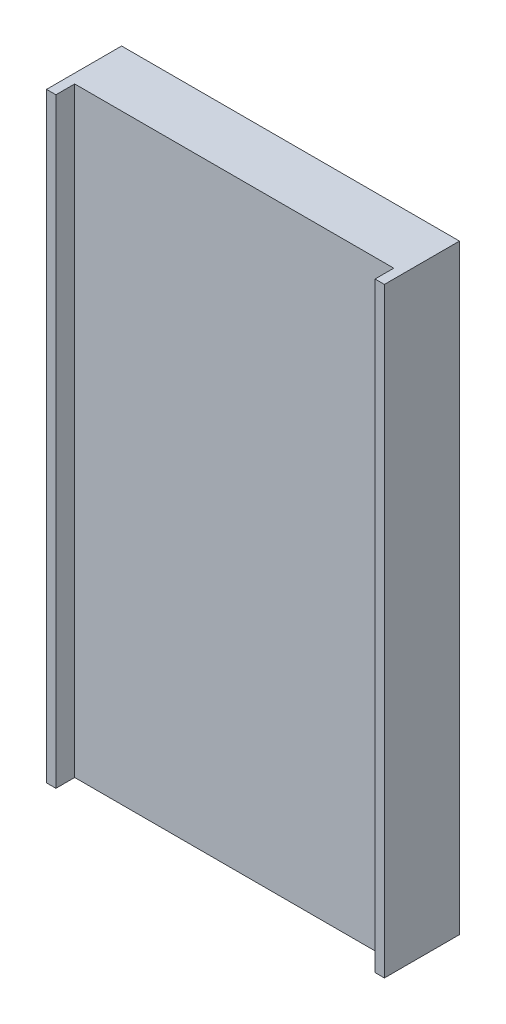
ISO-10303-21;
HEADER;
FILE_DESCRIPTION(('STEP AP214'),'2;1');
FILE_NAME('part.step','',(''),(''),'','','');
FILE_SCHEMA(('AUTOMOTIVE_DESIGN { 1 0 10303 214 1 1 1 1 }'));
ENDSEC;
DATA;
#1=APPLICATION_CONTEXT('core data for automotive mechanical design processes');
#2=APPLICATION_PROTOCOL_DEFINITION('international standard','automotive_design',2000,#1);
#3=PRODUCT_CONTEXT('',#1,'mechanical');
#4=PRODUCT('Part','Part','',(#3));
#5=PRODUCT_RELATED_PRODUCT_CATEGORY('part','',(#4));
#6=PRODUCT_DEFINITION_FORMATION('','',#4);
#7=PRODUCT_DEFINITION_CONTEXT('part definition',#1,'design');
#8=PRODUCT_DEFINITION('design','',#6,#7);
#9=PRODUCT_DEFINITION_SHAPE('','',#8);
#10=(LENGTH_UNIT() NAMED_UNIT(*) SI_UNIT(.MILLI.,.METRE.));
#11=(NAMED_UNIT(*) PLANE_ANGLE_UNIT() SI_UNIT($,.RADIAN.));
#12=(NAMED_UNIT(*) SI_UNIT($,.STERADIAN.) SOLID_ANGLE_UNIT());
#13=UNCERTAINTY_MEASURE_WITH_UNIT(LENGTH_MEASURE(1.E-05),#10,'distance_accuracy_value','');
#14=(GEOMETRIC_REPRESENTATION_CONTEXT(3) GLOBAL_UNCERTAINTY_ASSIGNED_CONTEXT((#13)) GLOBAL_UNIT_ASSIGNED_CONTEXT((#10,
#11,#12)) REPRESENTATION_CONTEXT('',''));
#15=CARTESIAN_POINT('',(0.,0.,0.));
#16=DIRECTION('',(0.,0.,1.));
#17=DIRECTION('',(1.,0.,0.));
#18=AXIS2_PLACEMENT_3D('',#15,#16,#17);
#19=CARTESIAN_POINT('',(0.,4.,0.75));
#20=DIRECTION('',(0.,1.,0.));
#21=DIRECTION('',(0.,0.,1.));
#22=AXIS2_PLACEMENT_3D('',#19,#20,#21);
#23=PLANE('',#22);
#24=DIRECTION('',(1.,0.,0.));
#25=VECTOR('',#24,1.);
#26=CARTESIAN_POINT('',(0.,4.,0.));
#27=LINE('',#26,#25);
#28=CARTESIAN_POINT('',(-2.25,4.,0.));
#29=VERTEX_POINT('',#28);
#30=CARTESIAN_POINT('',(2.25,4.,0.));
#31=VERTEX_POINT('',#30);
#32=EDGE_CURVE('E156',#29,#31,#27,.T.);
#33=ORIENTED_EDGE('',*,*,#32,.F.);
#34=DIRECTION('',(0.,0.,-1.));
#35=VECTOR('',#34,1.);
#36=CARTESIAN_POINT('',(-2.25,4.,1.));
#37=LINE('',#36,#35);
#38=CARTESIAN_POINT('',(-2.25,4.,1.));
#39=VERTEX_POINT('',#38);
#40=EDGE_CURVE('E108',#39,#29,#37,.T.);
#41=ORIENTED_EDGE('',*,*,#40,.F.);
#42=DIRECTION('',(1.,0.,0.));
#43=VECTOR('',#42,1.);
#44=CARTESIAN_POINT('',(0.,4.,1.));
#45=LINE('',#44,#43);
#46=CARTESIAN_POINT('',(-2.125,4.,1.));
#47=VERTEX_POINT('',#46);
#48=EDGE_CURVE('E113',#39,#47,#45,.T.);
#49=ORIENTED_EDGE('',*,*,#48,.T.);
#50=DIRECTION('',(0.,0.,-1.));
#51=VECTOR('',#50,1.);
#52=CARTESIAN_POINT('',(-2.125,4.,1.));
#53=LINE('',#52,#51);
#54=CARTESIAN_POINT('',(-2.125,4.,0.75));
#55=VERTEX_POINT('',#54);
#56=EDGE_CURVE('E101',#47,#55,#53,.T.);
#57=ORIENTED_EDGE('',*,*,#56,.T.);
#58=DIRECTION('',(1.,0.,0.));
#59=VECTOR('',#58,1.);
#60=CARTESIAN_POINT('',(0.,4.,0.75));
#61=LINE('',#60,#59);
#62=CARTESIAN_POINT('',(2.125,4.,0.75));
#63=VERTEX_POINT('',#62);
#64=EDGE_CURVE('E158',#55,#63,#61,.T.);
#65=ORIENTED_EDGE('',*,*,#64,.T.);
#66=DIRECTION('',(0.,0.,-1.));
#67=VECTOR('',#66,1.);
#68=CARTESIAN_POINT('',(2.125,4.,1.));
#69=LINE('',#68,#67);
#70=CARTESIAN_POINT('',(2.125,4.,1.));
#71=VERTEX_POINT('',#70);
#72=EDGE_CURVE('E153',#71,#63,#69,.T.);
#73=ORIENTED_EDGE('',*,*,#72,.F.);
#74=DIRECTION('',(1.,0.,0.));
#75=VECTOR('',#74,1.);
#76=CARTESIAN_POINT('',(0.,4.,1.));
#77=LINE('',#76,#75);
#78=CARTESIAN_POINT('',(2.25,4.,1.));
#79=VERTEX_POINT('',#78);
#80=EDGE_CURVE('E132',#71,#79,#77,.T.);
#81=ORIENTED_EDGE('',*,*,#80,.T.);
#82=DIRECTION('',(0.,0.,-1.));
#83=VECTOR('',#82,1.);
#84=CARTESIAN_POINT('',(2.25,4.,1.));
#85=LINE('',#84,#83);
#86=EDGE_CURVE('E142',#79,#31,#85,.T.);
#87=ORIENTED_EDGE('',*,*,#86,.T.);
#88=EDGE_LOOP('',(#33,#41,#49,#57,#65,#73,#81,#87));
#89=FACE_BOUND('',#88,.T.);
#90=ADVANCED_FACE('F36',(#89),#23,.T.);
#91=CARTESIAN_POINT('',(0.,-4.,0.75));
#92=DIRECTION('',(0.,1.,0.));
#93=DIRECTION('',(0.,0.,1.));
#94=AXIS2_PLACEMENT_3D('',#91,#92,#93);
#95=PLANE('',#94);
#96=DIRECTION('',(1.,0.,0.));
#97=VECTOR('',#96,1.);
#98=CARTESIAN_POINT('',(0.,-4.,0.));
#99=LINE('',#98,#97);
#100=CARTESIAN_POINT('',(-2.25,-4.,0.));
#101=VERTEX_POINT('',#100);
#102=CARTESIAN_POINT('',(2.25,-4.,0.));
#103=VERTEX_POINT('',#102);
#104=EDGE_CURVE('E39',#101,#103,#99,.T.);
#105=ORIENTED_EDGE('',*,*,#104,.T.);
#106=DIRECTION('',(0.,0.,-1.));
#107=VECTOR('',#106,1.);
#108=CARTESIAN_POINT('',(2.25,-4.,1.));
#109=LINE('',#108,#107);
#110=CARTESIAN_POINT('',(2.25,-4.,1.));
#111=VERTEX_POINT('',#110);
#112=EDGE_CURVE('E147',#111,#103,#109,.T.);
#113=ORIENTED_EDGE('',*,*,#112,.F.);
#114=DIRECTION('',(1.,0.,0.));
#115=VECTOR('',#114,1.);
#116=CARTESIAN_POINT('',(0.,-4.,1.));
#117=LINE('',#116,#115);
#118=CARTESIAN_POINT('',(2.125,-4.,1.));
#119=VERTEX_POINT('',#118);
#120=EDGE_CURVE('E137',#119,#111,#117,.T.);
#121=ORIENTED_EDGE('',*,*,#120,.F.);
#122=DIRECTION('',(0.,0.,-1.));
#123=VECTOR('',#122,1.);
#124=CARTESIAN_POINT('',(2.125,-4.,1.));
#125=LINE('',#124,#123);
#126=CARTESIAN_POINT('',(2.125,-4.,0.75));
#127=VERTEX_POINT('',#126);
#128=EDGE_CURVE('E150',#119,#127,#125,.T.);
#129=ORIENTED_EDGE('',*,*,#128,.T.);
#130=DIRECTION('',(1.,0.,0.));
#131=VECTOR('',#130,1.);
#132=CARTESIAN_POINT('',(0.,-4.,0.75));
#133=LINE('',#132,#131);
#134=CARTESIAN_POINT('',(-2.125,-4.,0.75));
#135=VERTEX_POINT('',#134);
#136=EDGE_CURVE('E11',#135,#127,#133,.T.);
#137=ORIENTED_EDGE('',*,*,#136,.F.);
#138=DIRECTION('',(0.,0.,-1.));
#139=VECTOR('',#138,1.);
#140=CARTESIAN_POINT('',(-2.125,-4.,1.));
#141=LINE('',#140,#139);
#142=CARTESIAN_POINT('',(-2.125,-4.,1.));
#143=VERTEX_POINT('',#142);
#144=EDGE_CURVE('E52',#143,#135,#141,.T.);
#145=ORIENTED_EDGE('',*,*,#144,.F.);
#146=DIRECTION('',(1.,0.,0.));
#147=VECTOR('',#146,1.);
#148=CARTESIAN_POINT('',(0.,-4.,1.));
#149=LINE('',#148,#147);
#150=CARTESIAN_POINT('',(-2.25,-4.,1.));
#151=VERTEX_POINT('',#150);
#152=EDGE_CURVE('E115',#151,#143,#149,.T.);
#153=ORIENTED_EDGE('',*,*,#152,.F.);
#154=DIRECTION('',(0.,0.,-1.));
#155=VECTOR('',#154,1.);
#156=CARTESIAN_POINT('',(-2.25,-4.,1.));
#157=LINE('',#156,#155);
#158=EDGE_CURVE('E128',#151,#101,#157,.T.);
#159=ORIENTED_EDGE('',*,*,#158,.T.);
#160=EDGE_LOOP('',(#105,#113,#121,#129,#137,#145,#153,#159));
#161=FACE_BOUND('',#160,.T.);
#162=ADVANCED_FACE('F164',(#161),#95,.F.);
#163=CARTESIAN_POINT('',(0.,0.,0.75));
#164=DIRECTION('',(0.,0.,1.));
#165=DIRECTION('',(1.,0.,0.));
#166=AXIS2_PLACEMENT_3D('',#163,#164,#165);
#167=PLANE('',#166);
#168=DIRECTION('',(0.,-1.,0.));
#169=VECTOR('',#168,1.);
#170=CARTESIAN_POINT('',(2.125,0.,0.75));
#171=LINE('',#170,#169);
#172=EDGE_CURVE('E59',#63,#127,#171,.T.);
#173=ORIENTED_EDGE('',*,*,#172,.F.);
#174=ORIENTED_EDGE('',*,*,#64,.F.);
#175=DIRECTION('',(0.,-1.,0.));
#176=VECTOR('',#175,1.);
#177=CARTESIAN_POINT('',(-2.125,0.,0.75));
#178=LINE('',#177,#176);
#179=EDGE_CURVE('E44',#55,#135,#178,.T.);
#180=ORIENTED_EDGE('',*,*,#179,.T.);
#181=ORIENTED_EDGE('',*,*,#136,.T.);
#182=EDGE_LOOP('',(#173,#174,#180,#181));
#183=FACE_BOUND('',#182,.T.);
#184=ADVANCED_FACE('F174',(#183),#167,.T.);
#185=CARTESIAN_POINT('',(0.,0.,0.));
#186=DIRECTION('',(0.,0.,1.));
#187=DIRECTION('',(1.,0.,0.));
#188=AXIS2_PLACEMENT_3D('',#185,#186,#187);
#189=PLANE('',#188);
#190=ORIENTED_EDGE('',*,*,#32,.T.);
#191=DIRECTION('',(0.,-1.,0.));
#192=VECTOR('',#191,1.);
#193=CARTESIAN_POINT('',(2.25,0.,0.));
#194=LINE('',#193,#192);
#195=EDGE_CURVE('E107',#31,#103,#194,.T.);
#196=ORIENTED_EDGE('',*,*,#195,.T.);
#197=ORIENTED_EDGE('',*,*,#104,.F.);
#198=DIRECTION('',(0.,-1.,0.));
#199=VECTOR('',#198,1.);
#200=CARTESIAN_POINT('',(-2.25,0.,0.));
#201=LINE('',#200,#199);
#202=EDGE_CURVE('E116',#29,#101,#201,.T.);
#203=ORIENTED_EDGE('',*,*,#202,.F.);
#204=EDGE_LOOP('',(#190,#196,#197,#203));
#205=FACE_BOUND('',#204,.T.);
#206=ADVANCED_FACE('F171',(#205),#189,.F.);
#207=CARTESIAN_POINT('',(2.125,0.,1.));
#208=DIRECTION('',(1.,0.,0.));
#209=DIRECTION('',(0.,0.,-1.));
#210=AXIS2_PLACEMENT_3D('',#207,#208,#209);
#211=PLANE('',#210);
#212=ORIENTED_EDGE('',*,*,#72,.T.);
#213=ORIENTED_EDGE('',*,*,#172,.T.);
#214=ORIENTED_EDGE('',*,*,#128,.F.);
#215=DIRECTION('',(0.,-1.,0.));
#216=VECTOR('',#215,1.);
#217=CARTESIAN_POINT('',(2.125,0.,1.));
#218=LINE('',#217,#216);
#219=EDGE_CURVE('E135',#71,#119,#218,.T.);
#220=ORIENTED_EDGE('',*,*,#219,.F.);
#221=EDGE_LOOP('',(#212,#213,#214,#220));
#222=FACE_BOUND('',#221,.T.);
#223=ADVANCED_FACE('F173',(#222),#211,.F.);
#224=CARTESIAN_POINT('',(2.25,0.,1.));
#225=DIRECTION('',(1.,0.,0.));
#226=DIRECTION('',(0.,1.,0.));
#227=AXIS2_PLACEMENT_3D('',#224,#225,#226);
#228=PLANE('',#227);
#229=ORIENTED_EDGE('',*,*,#195,.F.);
#230=ORIENTED_EDGE('',*,*,#86,.F.);
#231=DIRECTION('',(0.,-1.,0.));
#232=VECTOR('',#231,1.);
#233=CARTESIAN_POINT('',(2.25,0.,1.));
#234=LINE('',#233,#232);
#235=EDGE_CURVE('E139',#79,#111,#234,.T.);
#236=ORIENTED_EDGE('',*,*,#235,.T.);
#237=ORIENTED_EDGE('',*,*,#112,.T.);
#238=EDGE_LOOP('',(#229,#230,#236,#237));
#239=FACE_BOUND('',#238,.T.);
#240=ADVANCED_FACE('F169',(#239),#228,.T.);
#241=CARTESIAN_POINT('',(0.,0.,1.));
#242=DIRECTION('',(0.,0.,1.));
#243=DIRECTION('',(1.,0.,0.));
#244=AXIS2_PLACEMENT_3D('',#241,#242,#243);
#245=PLANE('',#244);
#246=ORIENTED_EDGE('',*,*,#80,.F.);
#247=ORIENTED_EDGE('',*,*,#219,.T.);
#248=ORIENTED_EDGE('',*,*,#120,.T.);
#249=ORIENTED_EDGE('',*,*,#235,.F.);
#250=EDGE_LOOP('',(#246,#247,#248,#249));
#251=FACE_BOUND('',#250,.T.);
#252=ADVANCED_FACE('F215',(#251),#245,.T.);
#253=CARTESIAN_POINT('',(-2.125,0.,1.));
#254=DIRECTION('',(1.,0.,0.));
#255=DIRECTION('',(0.,0.,-1.));
#256=AXIS2_PLACEMENT_3D('',#253,#254,#255);
#257=PLANE('',#256);
#258=ORIENTED_EDGE('',*,*,#179,.F.);
#259=ORIENTED_EDGE('',*,*,#56,.F.);
#260=DIRECTION('',(0.,-1.,0.));
#261=VECTOR('',#260,1.);
#262=CARTESIAN_POINT('',(-2.125,0.,1.));
#263=LINE('',#262,#261);
#264=EDGE_CURVE('E104',#47,#143,#263,.T.);
#265=ORIENTED_EDGE('',*,*,#264,.T.);
#266=ORIENTED_EDGE('',*,*,#144,.T.);
#267=EDGE_LOOP('',(#258,#259,#265,#266));
#268=FACE_BOUND('',#267,.T.);
#269=ADVANCED_FACE('F103',(#268),#257,.T.);
#270=CARTESIAN_POINT('',(-2.25,0.,1.));
#271=DIRECTION('',(1.,0.,0.));
#272=DIRECTION('',(0.,1.,0.));
#273=AXIS2_PLACEMENT_3D('',#270,#271,#272);
#274=PLANE('',#273);
#275=ORIENTED_EDGE('',*,*,#202,.T.);
#276=ORIENTED_EDGE('',*,*,#158,.F.);
#277=DIRECTION('',(0.,-1.,0.));
#278=VECTOR('',#277,1.);
#279=CARTESIAN_POINT('',(-2.25,0.,1.));
#280=LINE('',#279,#278);
#281=EDGE_CURVE('E120',#39,#151,#280,.T.);
#282=ORIENTED_EDGE('',*,*,#281,.F.);
#283=ORIENTED_EDGE('',*,*,#40,.T.);
#284=EDGE_LOOP('',(#275,#276,#282,#283));
#285=FACE_BOUND('',#284,.T.);
#286=ADVANCED_FACE('F233',(#285),#274,.F.);
#287=CARTESIAN_POINT('',(0.,0.,1.));
#288=DIRECTION('',(0.,0.,1.));
#289=DIRECTION('',(1.,0.,0.));
#290=AXIS2_PLACEMENT_3D('',#287,#288,#289);
#291=PLANE('',#290);
#292=ORIENTED_EDGE('',*,*,#264,.F.);
#293=ORIENTED_EDGE('',*,*,#48,.F.);
#294=ORIENTED_EDGE('',*,*,#281,.T.);
#295=ORIENTED_EDGE('',*,*,#152,.T.);
#296=EDGE_LOOP('',(#292,#293,#294,#295));
#297=FACE_BOUND('',#296,.T.);
#298=ADVANCED_FACE('F112',(#297),#291,.T.);
#299=CLOSED_SHELL('',(#90,#162,#184,#206,#223,#240,#252,#269,#286,#298));
#300=MANIFOLD_SOLID_BREP('B2',#299);
#301=ADVANCED_BREP_SHAPE_REPRESENTATION('',(#18,#300),#14);
#302=SHAPE_DEFINITION_REPRESENTATION(#9,#301);
ENDSEC;
END-ISO-10303-21;
